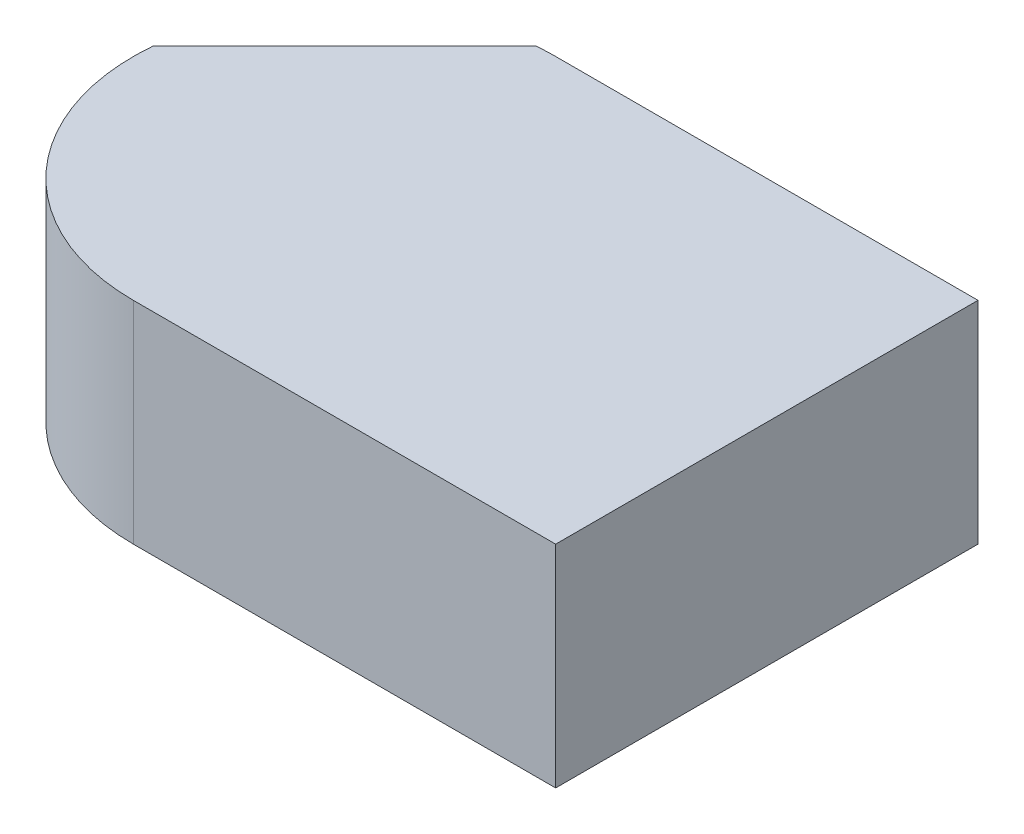
ISO-10303-21;
HEADER;
FILE_DESCRIPTION(('STEP AP214'),'2;1');
FILE_NAME('part.step','',(''),(''),'','','');
FILE_SCHEMA(('AUTOMOTIVE_DESIGN { 1 0 10303 214 1 1 1 1 }'));
ENDSEC;
DATA;
#1=APPLICATION_CONTEXT('core data for automotive mechanical design processes');
#2=APPLICATION_PROTOCOL_DEFINITION('international standard','automotive_design',2000,#1);
#3=PRODUCT_CONTEXT('',#1,'mechanical');
#4=PRODUCT('Part','Part','',(#3));
#5=PRODUCT_RELATED_PRODUCT_CATEGORY('part','',(#4));
#6=PRODUCT_DEFINITION_FORMATION('','',#4);
#7=PRODUCT_DEFINITION_CONTEXT('part definition',#1,'design');
#8=PRODUCT_DEFINITION('design','',#6,#7);
#9=PRODUCT_DEFINITION_SHAPE('','',#8);
#10=(LENGTH_UNIT() NAMED_UNIT(*) SI_UNIT(.MILLI.,.METRE.));
#11=(NAMED_UNIT(*) PLANE_ANGLE_UNIT() SI_UNIT($,.RADIAN.));
#12=(NAMED_UNIT(*) SI_UNIT($,.STERADIAN.) SOLID_ANGLE_UNIT());
#13=UNCERTAINTY_MEASURE_WITH_UNIT(LENGTH_MEASURE(1.E-05),#10,'distance_accuracy_value','');
#14=(GEOMETRIC_REPRESENTATION_CONTEXT(3) GLOBAL_UNCERTAINTY_ASSIGNED_CONTEXT((#13)) GLOBAL_UNIT_ASSIGNED_CONTEXT((#10,
#11,#12)) REPRESENTATION_CONTEXT('',''));
#15=CARTESIAN_POINT('',(0.,0.,0.));
#16=DIRECTION('',(0.,0.,1.));
#17=DIRECTION('',(1.,0.,0.));
#18=AXIS2_PLACEMENT_3D('',#15,#16,#17);
#19=CARTESIAN_POINT('',(0.,0.,0.));
#20=DIRECTION('',(0.,1.,0.));
#21=DIRECTION('',(1.,0.,0.));
#22=AXIS2_PLACEMENT_3D('',#19,#20,#21);
#23=PLANE('',#22);
#24=CARTESIAN_POINT('',(1.05,0.,-1.8));
#25=DIRECTION('',(0.,1.,0.));
#26=DIRECTION('',(0.,0.,-1.));
#27=AXIS2_PLACEMENT_3D('',#24,#25,#26);
#28=CIRCLE('',#27,0.1);
#29=CARTESIAN_POINT('',(1.05,0.,-1.9));
#30=VERTEX_POINT('',#29);
#31=CARTESIAN_POINT('',(1.041017074242,0.,-1.899595718004));
#32=VERTEX_POINT('',#31);
#33=EDGE_CURVE('E11',#30,#32,#28,.T.);
#34=ORIENTED_EDGE('',*,*,#33,.F.);
#35=DIRECTION('',(-1.,0.,0.));
#36=VECTOR('',#35,1.);
#37=CARTESIAN_POINT('',(1.25,0.,-1.9));
#38=LINE('',#37,#36);
#39=CARTESIAN_POINT('',(1.25,0.,-1.9));
#40=VERTEX_POINT('',#39);
#41=EDGE_CURVE('E25',#40,#30,#38,.T.);
#42=ORIENTED_EDGE('',*,*,#41,.F.);
#43=DIRECTION('',(0.,0.,-1.));
#44=VECTOR('',#43,1.);
#45=CARTESIAN_POINT('',(1.25,0.,-1.7));
#46=LINE('',#45,#44);
#47=CARTESIAN_POINT('',(1.25,0.,-1.7));
#48=VERTEX_POINT('',#47);
#49=EDGE_CURVE('E145',#48,#40,#46,.T.);
#50=ORIENTED_EDGE('',*,*,#49,.F.);
#51=DIRECTION('',(1.,0.,0.));
#52=VECTOR('',#51,1.);
#53=CARTESIAN_POINT('',(1.05,0.,-1.7));
#54=LINE('',#53,#52);
#55=CARTESIAN_POINT('',(1.05,0.,-1.7));
#56=VERTEX_POINT('',#55);
#57=EDGE_CURVE('E141',#56,#48,#54,.T.);
#58=ORIENTED_EDGE('',*,*,#57,.F.);
#59=CARTESIAN_POINT('',(1.05,0.,-1.8));
#60=DIRECTION('',(0.,1.,0.));
#61=DIRECTION('',(-0.995957180044504,0.,-0.0898292575823653));
#62=AXIS2_PLACEMENT_3D('',#59,#60,#61);
#63=CIRCLE('',#62,0.1);
#64=CARTESIAN_POINT('',(0.950404281995,0.,-1.808982925758));
#65=VERTEX_POINT('',#64);
#66=EDGE_CURVE('E89',#65,#56,#63,.T.);
#67=ORIENTED_EDGE('',*,*,#66,.F.);
#68=DIRECTION('',(0.707106781186548,0.,-0.707106781186548));
#69=VECTOR('',#68,1.);
#70=CARTESIAN_POINT('',(0.950404281995,0.,-1.808982925758));
#71=LINE('',#70,#69);
#72=EDGE_CURVE('E134',#65,#32,#71,.T.);
#73=ORIENTED_EDGE('',*,*,#72,.T.);
#74=EDGE_LOOP('',(#34,#42,#50,#58,#67,#73));
#75=FACE_BOUND('',#74,.T.);
#76=ADVANCED_FACE('F17',(#75),#23,.F.);
#77=CARTESIAN_POINT('',(0.950404281995,-0.02,-1.808982925758));
#78=DIRECTION('',(0.707106781186548,0.,0.707106781186548));
#79=DIRECTION('',(0.707106781186548,0.,-0.707106781186548));
#80=AXIS2_PLACEMENT_3D('',#77,#78,#79);
#81=PLANE('',#80);
#82=DIRECTION('',(0.,1.,0.));
#83=VECTOR('',#82,1.);
#84=CARTESIAN_POINT('',(0.950404281995,0.,-1.808982925758));
#85=LINE('',#84,#83);
#86=CARTESIAN_POINT('',(0.950404281995,0.1,-1.808982925758));
#87=VERTEX_POINT('',#86);
#88=EDGE_CURVE('E130',#65,#87,#85,.T.);
#89=ORIENTED_EDGE('',*,*,#88,.T.);
#90=DIRECTION('',(0.707106781186548,0.,-0.707106781186548));
#91=VECTOR('',#90,1.);
#92=CARTESIAN_POINT('',(0.950404281995,0.1,-1.808982925758));
#93=LINE('',#92,#91);
#94=CARTESIAN_POINT('',(1.041017074242,0.1,-1.899595718004));
#95=VERTEX_POINT('',#94);
#96=EDGE_CURVE('E84',#87,#95,#93,.T.);
#97=ORIENTED_EDGE('',*,*,#96,.T.);
#98=DIRECTION('',(0.,1.,0.));
#99=VECTOR('',#98,1.);
#100=CARTESIAN_POINT('',(1.041017074242,0.,-1.899595718004));
#101=LINE('',#100,#99);
#102=EDGE_CURVE('E122',#32,#95,#101,.T.);
#103=ORIENTED_EDGE('',*,*,#102,.F.);
#104=ORIENTED_EDGE('',*,*,#72,.F.);
#105=EDGE_LOOP('',(#89,#97,#103,#104));
#106=FACE_BOUND('',#105,.T.);
#107=ADVANCED_FACE('F161',(#106),#81,.F.);
#108=CARTESIAN_POINT('',(1.05,0.,-1.8));
#109=DIRECTION('',(0.,1.,0.));
#110=DIRECTION('',(0.0449600931678338,0.,0.998988783732));
#111=AXIS2_PLACEMENT_3D('',#108,#109,#110);
#112=CYLINDRICAL_SURFACE('',#111,0.1);
#113=CARTESIAN_POINT('',(1.05,0.1,-1.8));
#114=DIRECTION('',(0.,1.,0.));
#115=DIRECTION('',(0.,0.,-1.));
#116=AXIS2_PLACEMENT_3D('',#113,#114,#115);
#117=CIRCLE('',#116,0.1);
#118=CARTESIAN_POINT('',(1.05,0.1,-1.9));
#119=VERTEX_POINT('',#118);
#120=EDGE_CURVE('E118',#119,#95,#117,.T.);
#121=ORIENTED_EDGE('',*,*,#120,.F.);
#122=DIRECTION('',(0.,1.,0.));
#123=VECTOR('',#122,1.);
#124=CARTESIAN_POINT('',(1.05,0.,-1.9));
#125=LINE('',#124,#123);
#126=EDGE_CURVE('E113',#30,#119,#125,.T.);
#127=ORIENTED_EDGE('',*,*,#126,.F.);
#128=ORIENTED_EDGE('',*,*,#33,.T.);
#129=ORIENTED_EDGE('',*,*,#102,.T.);
#130=EDGE_LOOP('',(#121,#127,#128,#129));
#131=FACE_BOUND('',#130,.T.);
#132=ADVANCED_FACE('F163',(#131),#112,.T.);
#133=CARTESIAN_POINT('',(1.25,0.,-1.9));
#134=DIRECTION('',(0.,0.,-1.));
#135=DIRECTION('',(-1.,0.,0.));
#136=AXIS2_PLACEMENT_3D('',#133,#134,#135);
#137=PLANE('',#136);
#138=ORIENTED_EDGE('',*,*,#126,.T.);
#139=DIRECTION('',(-1.,0.,0.));
#140=VECTOR('',#139,1.);
#141=CARTESIAN_POINT('',(1.25,0.1,-1.9));
#142=LINE('',#141,#140);
#143=CARTESIAN_POINT('',(1.25,0.1,-1.9));
#144=VERTEX_POINT('',#143);
#145=EDGE_CURVE('E108',#144,#119,#142,.T.);
#146=ORIENTED_EDGE('',*,*,#145,.F.);
#147=DIRECTION('',(0.,1.,0.));
#148=VECTOR('',#147,1.);
#149=CARTESIAN_POINT('',(1.25,0.,-1.9));
#150=LINE('',#149,#148);
#151=EDGE_CURVE('E103',#40,#144,#150,.T.);
#152=ORIENTED_EDGE('',*,*,#151,.F.);
#153=ORIENTED_EDGE('',*,*,#41,.T.);
#154=EDGE_LOOP('',(#138,#146,#152,#153));
#155=FACE_BOUND('',#154,.T.);
#156=ADVANCED_FACE('F155',(#155),#137,.T.);
#157=CARTESIAN_POINT('',(1.25,0.,-1.7));
#158=DIRECTION('',(1.,0.,0.));
#159=DIRECTION('',(0.,0.,-1.));
#160=AXIS2_PLACEMENT_3D('',#157,#158,#159);
#161=PLANE('',#160);
#162=ORIENTED_EDGE('',*,*,#151,.T.);
#163=DIRECTION('',(0.,0.,-1.));
#164=VECTOR('',#163,1.);
#165=CARTESIAN_POINT('',(1.25,0.1,-1.7));
#166=LINE('',#165,#164);
#167=CARTESIAN_POINT('',(1.25,0.1,-1.7));
#168=VERTEX_POINT('',#167);
#169=EDGE_CURVE('E99',#168,#144,#166,.T.);
#170=ORIENTED_EDGE('',*,*,#169,.F.);
#171=DIRECTION('',(0.,1.,0.));
#172=VECTOR('',#171,1.);
#173=CARTESIAN_POINT('',(1.25,0.,-1.7));
#174=LINE('',#173,#172);
#175=EDGE_CURVE('E75',#48,#168,#174,.T.);
#176=ORIENTED_EDGE('',*,*,#175,.F.);
#177=ORIENTED_EDGE('',*,*,#49,.T.);
#178=EDGE_LOOP('',(#162,#170,#176,#177));
#179=FACE_BOUND('',#178,.T.);
#180=ADVANCED_FACE('F157',(#179),#161,.T.);
#181=CARTESIAN_POINT('',(1.05,0.,-1.7));
#182=DIRECTION('',(0.,0.,1.));
#183=DIRECTION('',(1.,0.,0.));
#184=AXIS2_PLACEMENT_3D('',#181,#182,#183);
#185=PLANE('',#184);
#186=ORIENTED_EDGE('',*,*,#175,.T.);
#187=DIRECTION('',(1.,0.,0.));
#188=VECTOR('',#187,1.);
#189=CARTESIAN_POINT('',(1.05,0.1,-1.7));
#190=LINE('',#189,#188);
#191=CARTESIAN_POINT('',(1.05,0.1,-1.7));
#192=VERTEX_POINT('',#191);
#193=EDGE_CURVE('E67',#192,#168,#190,.T.);
#194=ORIENTED_EDGE('',*,*,#193,.F.);
#195=DIRECTION('',(0.,1.,0.));
#196=VECTOR('',#195,1.);
#197=CARTESIAN_POINT('',(1.05,0.,-1.7));
#198=LINE('',#197,#196);
#199=EDGE_CURVE('E72',#56,#192,#198,.T.);
#200=ORIENTED_EDGE('',*,*,#199,.F.);
#201=ORIENTED_EDGE('',*,*,#57,.T.);
#202=EDGE_LOOP('',(#186,#194,#200,#201));
#203=FACE_BOUND('',#202,.T.);
#204=ADVANCED_FACE('F69',(#203),#185,.T.);
#205=CARTESIAN_POINT('',(1.05,0.,-1.8));
#206=DIRECTION('',(0.,1.,0.));
#207=DIRECTION('',(0.73818333006861,0.,-0.674600156543724));
#208=AXIS2_PLACEMENT_3D('',#205,#206,#207);
#209=CYLINDRICAL_SURFACE('',#208,0.1);
#210=ORIENTED_EDGE('',*,*,#66,.T.);
#211=ORIENTED_EDGE('',*,*,#199,.T.);
#212=CARTESIAN_POINT('',(1.05,0.1,-1.8));
#213=DIRECTION('',(0.,1.,0.));
#214=DIRECTION('',(-0.995957180044504,0.,-0.0898292575823653));
#215=AXIS2_PLACEMENT_3D('',#212,#213,#214);
#216=CIRCLE('',#215,0.1);
#217=EDGE_CURVE('E81',#87,#192,#216,.T.);
#218=ORIENTED_EDGE('',*,*,#217,.F.);
#219=ORIENTED_EDGE('',*,*,#88,.F.);
#220=EDGE_LOOP('',(#210,#211,#218,#219));
#221=FACE_BOUND('',#220,.T.);
#222=ADVANCED_FACE('F88',(#221),#209,.T.);
#223=CARTESIAN_POINT('',(0.,0.1,0.));
#224=DIRECTION('',(0.,1.,0.));
#225=DIRECTION('',(1.,0.,0.));
#226=AXIS2_PLACEMENT_3D('',#223,#224,#225);
#227=PLANE('',#226);
#228=ORIENTED_EDGE('',*,*,#217,.T.);
#229=ORIENTED_EDGE('',*,*,#193,.T.);
#230=ORIENTED_EDGE('',*,*,#169,.T.);
#231=ORIENTED_EDGE('',*,*,#145,.T.);
#232=ORIENTED_EDGE('',*,*,#120,.T.);
#233=ORIENTED_EDGE('',*,*,#96,.F.);
#234=EDGE_LOOP('',(#228,#229,#230,#231,#232,#233));
#235=FACE_BOUND('',#234,.T.);
#236=ADVANCED_FACE('F82',(#235),#227,.T.);
#237=CLOSED_SHELL('',(#76,#107,#132,#156,#180,#204,#222,#236));
#238=MANIFOLD_SOLID_BREP('B1',#237);
#239=ADVANCED_BREP_SHAPE_REPRESENTATION('',(#18,#238),#14);
#240=SHAPE_DEFINITION_REPRESENTATION(#9,#239);
ENDSEC;
END-ISO-10303-21;
